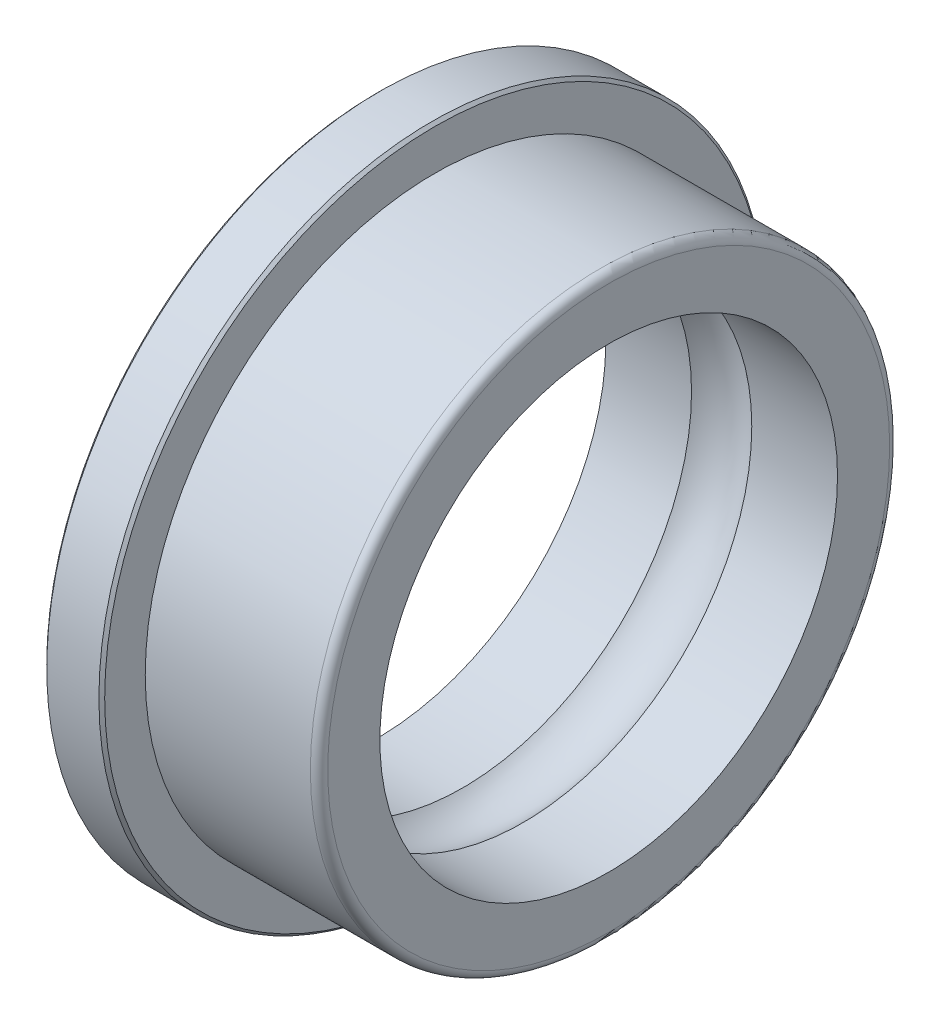
ISO-10303-21;
HEADER;
FILE_DESCRIPTION(('STEP AP214'),'2;1');
FILE_NAME('part.step','',(''),(''),'','','');
FILE_SCHEMA(('AUTOMOTIVE_DESIGN { 1 0 10303 214 1 1 1 1 }'));
ENDSEC;
DATA;
#1=APPLICATION_CONTEXT('core data for automotive mechanical design processes');
#2=APPLICATION_PROTOCOL_DEFINITION('international standard','automotive_design',2000,#1);
#3=PRODUCT_CONTEXT('',#1,'mechanical');
#4=PRODUCT('Part','Part','',(#3));
#5=PRODUCT_RELATED_PRODUCT_CATEGORY('part','',(#4));
#6=PRODUCT_DEFINITION_FORMATION('','',#4);
#7=PRODUCT_DEFINITION_CONTEXT('part definition',#1,'design');
#8=PRODUCT_DEFINITION('design','',#6,#7);
#9=PRODUCT_DEFINITION_SHAPE('','',#8);
#10=(LENGTH_UNIT() NAMED_UNIT(*) SI_UNIT(.MILLI.,.METRE.));
#11=(NAMED_UNIT(*) PLANE_ANGLE_UNIT() SI_UNIT($,.RADIAN.));
#12=(NAMED_UNIT(*) SI_UNIT($,.STERADIAN.) SOLID_ANGLE_UNIT());
#13=UNCERTAINTY_MEASURE_WITH_UNIT(LENGTH_MEASURE(1.E-05),#10,'distance_accuracy_value','');
#14=(GEOMETRIC_REPRESENTATION_CONTEXT(3) GLOBAL_UNCERTAINTY_ASSIGNED_CONTEXT((#13)) GLOBAL_UNIT_ASSIGNED_CONTEXT((#10,
#11,#12)) REPRESENTATION_CONTEXT('',''));
#15=CARTESIAN_POINT('',(0.,0.,0.));
#16=DIRECTION('',(0.,0.,1.));
#17=DIRECTION('',(1.,0.,0.));
#18=AXIS2_PLACEMENT_3D('',#15,#16,#17);
#19=CARTESIAN_POINT('',(-2.,0.,0.));
#20=DIRECTION('',(1.,0.,0.));
#21=DIRECTION('',(0.,0.,-1.));
#22=AXIS2_PLACEMENT_3D('',#19,#20,#21);
#23=CYLINDRICAL_SURFACE('',#22,5.);
#24=CARTESIAN_POINT('',(1.85,0.,0.));
#25=DIRECTION('',(-1.,0.,0.));
#26=DIRECTION('',(0.,0.,1.));
#27=AXIS2_PLACEMENT_3D('',#24,#25,#26);
#28=CIRCLE('',#27,5.);
#29=CARTESIAN_POINT('',(1.85,0.,5.));
#30=VERTEX_POINT('',#29);
#31=EDGE_CURVE('E29',#30,#30,#28,.F.);
#32=ORIENTED_EDGE('',*,*,#31,.F.);
#33=EDGE_LOOP('',(#32));
#34=FACE_BOUND('',#33,.T.);
#35=CARTESIAN_POINT('',(-1.,0.,0.));
#36=DIRECTION('',(1.,0.,0.));
#37=DIRECTION('',(0.,0.,-1.));
#38=AXIS2_PLACEMENT_3D('',#35,#36,#37);
#39=CIRCLE('',#38,5.);
#40=CARTESIAN_POINT('',(-1.,0.,-5.));
#41=VERTEX_POINT('',#40);
#42=EDGE_CURVE('E17',#41,#41,#39,.T.);
#43=ORIENTED_EDGE('',*,*,#42,.T.);
#44=EDGE_LOOP('',(#43));
#45=FACE_BOUND('',#44,.T.);
#46=ADVANCED_FACE('F14',(#34,#45),#23,.T.);
#47=CARTESIAN_POINT('',(1.85,0.,0.));
#48=DIRECTION('',(-1.,0.,0.));
#49=DIRECTION('',(0.,0.,1.));
#50=AXIS2_PLACEMENT_3D('',#47,#48,#49);
#51=TOROIDAL_SURFACE('',#50,4.85,0.15);
#52=ORIENTED_EDGE('',*,*,#31,.T.);
#53=EDGE_LOOP('',(#52));
#54=FACE_BOUND('',#53,.T.);
#55=CARTESIAN_POINT('',(2.,0.,0.));
#56=DIRECTION('',(-1.,0.,0.));
#57=DIRECTION('',(0.,0.,-1.));
#58=AXIS2_PLACEMENT_3D('',#55,#56,#57);
#59=CIRCLE('',#58,4.85);
#60=CARTESIAN_POINT('',(2.,0.,-4.85));
#61=VERTEX_POINT('',#60);
#62=EDGE_CURVE('E37',#61,#61,#59,.T.);
#63=ORIENTED_EDGE('',*,*,#62,.T.);
#64=EDGE_LOOP('',(#63));
#65=FACE_BOUND('',#64,.T.);
#66=ADVANCED_FACE('F50',(#54,#65),#51,.T.);
#67=CARTESIAN_POINT('',(-1.,5.7,0.));
#68=DIRECTION('',(-1.,0.,0.));
#69=DIRECTION('',(0.,0.,1.));
#70=AXIS2_PLACEMENT_3D('',#67,#68,#69);
#71=PLANE('',#70);
#72=ORIENTED_EDGE('',*,*,#42,.F.);
#73=EDGE_LOOP('',(#72));
#74=FACE_BOUND('',#73,.T.);
#75=CARTESIAN_POINT('',(-1.0000000000332,0.,0.));
#76=DIRECTION('',(-1.,0.,0.));
#77=DIRECTION('',(0.,0.,1.));
#78=AXIS2_PLACEMENT_3D('',#75,#76,#77);
#79=CIRCLE('',#78,5.70000000004711);
#80=CARTESIAN_POINT('',(-1.0000000000332,0.,5.70000000004711));
#81=VERTEX_POINT('',#80);
#82=EDGE_CURVE('E35',#81,#81,#79,.T.);
#83=ORIENTED_EDGE('',*,*,#82,.F.);
#84=EDGE_LOOP('',(#83));
#85=FACE_BOUND('',#84,.T.);
#86=ADVANCED_FACE('F57',(#74,#85),#71,.F.);
#87=CARTESIAN_POINT('',(2.,3.95,0.));
#88=DIRECTION('',(-1.,0.,0.));
#89=DIRECTION('',(0.,0.,1.));
#90=AXIS2_PLACEMENT_3D('',#87,#88,#89);
#91=PLANE('',#90);
#92=CARTESIAN_POINT('',(2.,0.,0.));
#93=DIRECTION('',(1.,0.,0.));
#94=DIRECTION('',(0.,0.,-1.));
#95=AXIS2_PLACEMENT_3D('',#92,#93,#94);
#96=CIRCLE('',#95,3.95);
#97=CARTESIAN_POINT('',(2.,0.,-3.95));
#98=VERTEX_POINT('',#97);
#99=EDGE_CURVE('E32',#98,#98,#96,.F.);
#100=ORIENTED_EDGE('',*,*,#99,.T.);
#101=EDGE_LOOP('',(#100));
#102=FACE_BOUND('',#101,.T.);
#103=ORIENTED_EDGE('',*,*,#62,.F.);
#104=EDGE_LOOP('',(#103));
#105=FACE_BOUND('',#104,.T.);
#106=ADVANCED_FACE('F98',(#102,#105),#91,.F.);
#107=CARTESIAN_POINT('',(-1.05000000002065,0.,0.));
#108=DIRECTION('',(-1.,0.,0.));
#109=DIRECTION('',(0.,0.,1.));
#110=AXIS2_PLACEMENT_3D('',#107,#108,#109);
#111=CONICAL_SURFACE('',#110,5.74999999997772,0.785398162829014);
#112=CARTESIAN_POINT('',(-1.05,0.,0.));
#113=DIRECTION('',(1.,0.,0.));
#114=DIRECTION('',(0.,0.,-1.));
#115=AXIS2_PLACEMENT_3D('',#112,#113,#114);
#116=CIRCLE('',#115,5.75);
#117=CARTESIAN_POINT('',(-1.05,0.,-5.75));
#118=VERTEX_POINT('',#117);
#119=EDGE_CURVE('E34',#118,#118,#116,.F.);
#120=ORIENTED_EDGE('',*,*,#119,.F.);
#121=EDGE_LOOP('',(#120));
#122=FACE_BOUND('',#121,.T.);
#123=ORIENTED_EDGE('',*,*,#82,.T.);
#124=EDGE_LOOP('',(#123));
#125=FACE_BOUND('',#124,.T.);
#126=ADVANCED_FACE('F108',(#122,#125),#111,.T.);
#127=CARTESIAN_POINT('',(-2.,0.,0.));
#128=DIRECTION('',(1.,0.,0.));
#129=DIRECTION('',(0.,0.,-1.));
#130=AXIS2_PLACEMENT_3D('',#127,#128,#129);
#131=CYLINDRICAL_SURFACE('',#130,3.95);
#132=CARTESIAN_POINT('',(0.520034614232553,0.,0.));
#133=DIRECTION('',(-1.,0.,0.));
#134=DIRECTION('',(0.,0.,1.));
#135=AXIS2_PLACEMENT_3D('',#132,#133,#134);
#136=CIRCLE('',#135,3.95);
#137=CARTESIAN_POINT('',(0.520034614232553,0.,3.95));
#138=VERTEX_POINT('',#137);
#139=EDGE_CURVE('E83',#138,#138,#136,.T.);
#140=ORIENTED_EDGE('',*,*,#139,.T.);
#141=EDGE_LOOP('',(#140));
#142=FACE_BOUND('',#141,.T.);
#143=ORIENTED_EDGE('',*,*,#99,.F.);
#144=EDGE_LOOP('',(#143));
#145=FACE_BOUND('',#144,.T.);
#146=ADVANCED_FACE('F140',(#142,#145),#131,.F.);
#147=CARTESIAN_POINT('',(-3.78660254308519,0.,0.));
#148=DIRECTION('',(1.,0.,0.));
#149=DIRECTION('',(0.,0.,-1.));
#150=AXIS2_PLACEMENT_3D('',#147,#148,#149);
#151=CYLINDRICAL_SURFACE('',#150,5.75);
#152=CARTESIAN_POINT('',(-1.9500000000221,0.,0.));
#153=DIRECTION('',(1.,0.,0.));
#154=DIRECTION('',(0.,0.,-1.));
#155=AXIS2_PLACEMENT_3D('',#152,#153,#154);
#156=CIRCLE('',#155,5.75000000003456);
#157=CARTESIAN_POINT('',(-1.9500000000221,0.,-5.75000000003456));
#158=VERTEX_POINT('',#157);
#159=EDGE_CURVE('E86',#158,#158,#156,.F.);
#160=ORIENTED_EDGE('',*,*,#159,.F.);
#161=EDGE_LOOP('',(#160));
#162=FACE_BOUND('',#161,.T.);
#163=ORIENTED_EDGE('',*,*,#119,.T.);
#164=EDGE_LOOP('',(#163));
#165=FACE_BOUND('',#164,.T.);
#166=ADVANCED_FACE('F77',(#162,#165),#151,.T.);
#167=CARTESIAN_POINT('',(0.,0.,0.));
#168=DIRECTION('',(-1.,0.,0.));
#169=DIRECTION('',(0.,0.,1.));
#170=AXIS2_PLACEMENT_3D('',#167,#168,#169);
#171=TOROIDAL_SURFACE('',#170,3.35,0.794);
#172=CARTESIAN_POINT('',(-0.520034614232553,0.,0.));
#173=DIRECTION('',(1.,0.,0.));
#174=DIRECTION('',(0.,0.,-1.));
#175=AXIS2_PLACEMENT_3D('',#172,#173,#174);
#176=CIRCLE('',#175,3.95);
#177=CARTESIAN_POINT('',(-0.520034614232553,0.,-3.95));
#178=VERTEX_POINT('',#177);
#179=EDGE_CURVE('E26',#178,#178,#176,.F.);
#180=ORIENTED_EDGE('',*,*,#179,.T.);
#181=EDGE_LOOP('',(#180));
#182=FACE_BOUND('',#181,.T.);
#183=ORIENTED_EDGE('',*,*,#139,.F.);
#184=EDGE_LOOP('',(#183));
#185=FACE_BOUND('',#184,.T.);
#186=ADVANCED_FACE('F72',(#182,#185),#171,.F.);
#187=CARTESIAN_POINT('',(-1.9500000000221,0.,0.));
#188=DIRECTION('',(1.,0.,0.));
#189=DIRECTION('',(0.,0.,-1.));
#190=AXIS2_PLACEMENT_3D('',#187,#188,#189);
#191=CONICAL_SURFACE('',#190,5.75000000003456,0.785398163397448);
#192=ORIENTED_EDGE('',*,*,#159,.T.);
#193=EDGE_LOOP('',(#192));
#194=FACE_BOUND('',#193,.T.);
#195=CARTESIAN_POINT('',(-2.00000000006639,0.,0.));
#196=DIRECTION('',(1.,0.,0.));
#197=DIRECTION('',(0.,0.,-1.));
#198=AXIS2_PLACEMENT_3D('',#195,#196,#197);
#199=CIRCLE('',#198,5.69999999999027);
#200=CARTESIAN_POINT('',(-2.00000000006639,0.,-5.69999999999027));
#201=VERTEX_POINT('',#200);
#202=EDGE_CURVE('E21',#201,#201,#199,.T.);
#203=ORIENTED_EDGE('',*,*,#202,.T.);
#204=EDGE_LOOP('',(#203));
#205=FACE_BOUND('',#204,.T.);
#206=ADVANCED_FACE('F66',(#194,#205),#191,.T.);
#207=CARTESIAN_POINT('',(-2.,0.,0.));
#208=DIRECTION('',(1.,0.,0.));
#209=DIRECTION('',(0.,0.,-1.));
#210=AXIS2_PLACEMENT_3D('',#207,#208,#209);
#211=CYLINDRICAL_SURFACE('',#210,3.95);
#212=CARTESIAN_POINT('',(-2.,0.,0.));
#213=DIRECTION('',(1.,0.,0.));
#214=DIRECTION('',(0.,0.,-1.));
#215=AXIS2_PLACEMENT_3D('',#212,#213,#214);
#216=CIRCLE('',#215,3.95);
#217=CARTESIAN_POINT('',(-2.,0.,-3.95));
#218=VERTEX_POINT('',#217);
#219=EDGE_CURVE('E9',#218,#218,#216,.F.);
#220=ORIENTED_EDGE('',*,*,#219,.T.);
#221=EDGE_LOOP('',(#220));
#222=FACE_BOUND('',#221,.T.);
#223=ORIENTED_EDGE('',*,*,#179,.F.);
#224=EDGE_LOOP('',(#223));
#225=FACE_BOUND('',#224,.T.);
#226=ADVANCED_FACE('F60',(#222,#225),#211,.F.);
#227=CARTESIAN_POINT('',(-2.,3.95,0.));
#228=DIRECTION('',(1.,0.,0.));
#229=DIRECTION('',(0.,0.,-1.));
#230=AXIS2_PLACEMENT_3D('',#227,#228,#229);
#231=PLANE('',#230);
#232=ORIENTED_EDGE('',*,*,#219,.F.);
#233=EDGE_LOOP('',(#232));
#234=FACE_BOUND('',#233,.T.);
#235=ORIENTED_EDGE('',*,*,#202,.F.);
#236=EDGE_LOOP('',(#235));
#237=FACE_BOUND('',#236,.T.);
#238=ADVANCED_FACE('F58',(#234,#237),#231,.F.);
#239=CLOSED_SHELL('',(#46,#66,#86,#106,#126,#146,#166,#186,#206,#226,#238));
#240=MANIFOLD_SOLID_BREP('B1',#239);
#241=ADVANCED_BREP_SHAPE_REPRESENTATION('',(#18,#240),#14);
#242=SHAPE_DEFINITION_REPRESENTATION(#9,#241);
ENDSEC;
END-ISO-10303-21;
